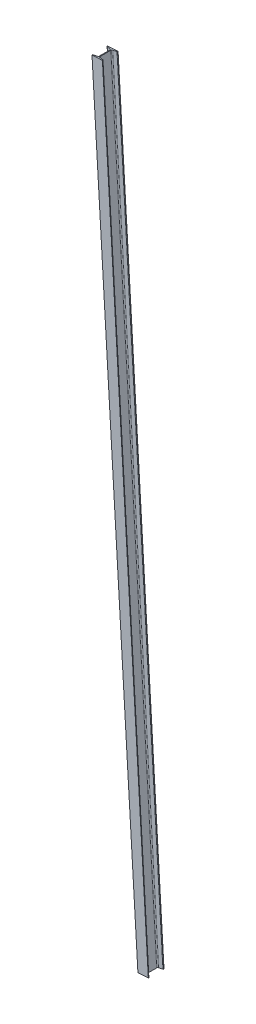
ISO-10303-21;
HEADER;
FILE_DESCRIPTION(('STEP AP214'),'2;1');
FILE_NAME('part.step','',(''),(''),'','','');
FILE_SCHEMA(('AUTOMOTIVE_DESIGN { 1 0 10303 214 1 1 1 1 }'));
ENDSEC;
DATA;
#1=APPLICATION_CONTEXT('core data for automotive mechanical design processes');
#2=APPLICATION_PROTOCOL_DEFINITION('international standard','automotive_design',2000,#1);
#3=PRODUCT_CONTEXT('',#1,'mechanical');
#4=PRODUCT('Part','Part','',(#3));
#5=PRODUCT_RELATED_PRODUCT_CATEGORY('part','',(#4));
#6=PRODUCT_DEFINITION_FORMATION('','',#4);
#7=PRODUCT_DEFINITION_CONTEXT('part definition',#1,'design');
#8=PRODUCT_DEFINITION('design','',#6,#7);
#9=PRODUCT_DEFINITION_SHAPE('','',#8);
#10=(LENGTH_UNIT() NAMED_UNIT(*) SI_UNIT(.MILLI.,.METRE.));
#11=(NAMED_UNIT(*) PLANE_ANGLE_UNIT() SI_UNIT($,.RADIAN.));
#12=(NAMED_UNIT(*) SI_UNIT($,.STERADIAN.) SOLID_ANGLE_UNIT());
#13=UNCERTAINTY_MEASURE_WITH_UNIT(LENGTH_MEASURE(1.E-05),#10,'distance_accuracy_value','');
#14=(GEOMETRIC_REPRESENTATION_CONTEXT(3) GLOBAL_UNCERTAINTY_ASSIGNED_CONTEXT((#13)) GLOBAL_UNIT_ASSIGNED_CONTEXT((#10,
#11,#12)) REPRESENTATION_CONTEXT('',''));
#15=CARTESIAN_POINT('',(0.,0.,0.));
#16=DIRECTION('',(0.,0.,1.));
#17=DIRECTION('',(1.,0.,0.));
#18=AXIS2_PLACEMENT_3D('',#15,#16,#17);
#19=CARTESIAN_POINT('',(9330.85472374432,1018.28452404438,-60.3249999999981));
#20=DIRECTION('',(0.,0.,-1.));
#21=DIRECTION('',(0.,1.,0.));
#22=AXIS2_PLACEMENT_3D('',#19,#20,#21);
#23=PLANE('',#22);
#24=DIRECTION('',(0.998235524222362,0.0593787687688712,0.));
#25=VECTOR('',#24,1.);
#26=CARTESIAN_POINT('',(9628.28666484125,-3981.93922254552,-60.3250000000196));
#27=LINE('',#26,#25);
#28=CARTESIAN_POINT('',(9560.76581433575,-3985.9556143408,-60.3250000000198));
#29=VERTEX_POINT('',#28);
#30=CARTESIAN_POINT('',(9628.28666484125,-3981.93922254552,-60.3250000000196));
#31=VERTEX_POINT('',#30);
#32=EDGE_CURVE('E262',#29,#31,#27,.T.);
#33=ORIENTED_EDGE('',*,*,#32,.T.);
#34=DIRECTION('',(0.0593787687688694,-0.998235524222362,0.));
#35=VECTOR('',#34,1.);
#36=CARTESIAN_POINT('',(9330.85472374432,1018.28452404438,-60.3249999999981));
#37=LINE('',#36,#35);
#38=CARTESIAN_POINT('',(9330.85472374432,1018.28452404438,-60.3249999999981));
#39=VERTEX_POINT('',#38);
#40=EDGE_CURVE('E12',#39,#31,#37,.T.);
#41=ORIENTED_EDGE('',*,*,#40,.F.);
#42=DIRECTION('',(0.998235524222362,0.0593787687688712,0.));
#43=VECTOR('',#42,1.);
#44=CARTESIAN_POINT('',(9330.85472374432,1018.28452404438,-60.3249999999981));
#45=LINE('',#44,#43);
#46=CARTESIAN_POINT('',(9263.33387323881,1014.2681322491,-60.3249999999983));
#47=VERTEX_POINT('',#46);
#48=EDGE_CURVE('E300',#47,#39,#45,.T.);
#49=ORIENTED_EDGE('',*,*,#48,.F.);
#50=DIRECTION('',(0.0593787687688694,-0.998235524222362,0.));
#51=VECTOR('',#50,1.);
#52=CARTESIAN_POINT('',(9263.33387323881,1014.2681322491,-60.3249999999983));
#53=LINE('',#52,#51);
#54=EDGE_CURVE('E258',#47,#29,#53,.T.);
#55=ORIENTED_EDGE('',*,*,#54,.T.);
#56=EDGE_LOOP('',(#33,#41,#49,#55));
#57=FACE_BOUND('',#56,.T.);
#58=ADVANCED_FACE('F94',(#57),#23,.F.);
#59=CARTESIAN_POINT('',(9330.85472374432,1018.28452404438,-62.7863839406728));
#60=DIRECTION('',(-0.998235524222362,-0.0593787687688694,0.));
#61=DIRECTION('',(0.0593787687688694,-0.998235524222362,0.));
#62=AXIS2_PLACEMENT_3D('',#59,#60,#61);
#63=PLANE('',#62);
#64=DIRECTION('',(0.,0.,-1.));
#65=VECTOR('',#64,1.);
#66=CARTESIAN_POINT('',(9628.28666484125,-3981.93922254552,-62.7863839406943));
#67=LINE('',#66,#65);
#68=CARTESIAN_POINT('',(9628.28666484125,-3981.93922254552,-62.7863839406943));
#69=VERTEX_POINT('',#68);
#70=EDGE_CURVE('E265',#31,#69,#67,.T.);
#71=ORIENTED_EDGE('',*,*,#70,.T.);
#72=DIRECTION('',(0.0593787687688694,-0.998235524222362,0.));
#73=VECTOR('',#72,1.);
#74=CARTESIAN_POINT('',(9330.85472374432,1018.28452404438,-62.7863839406728));
#75=LINE('',#74,#73);
#76=CARTESIAN_POINT('',(9330.85472374432,1018.28452404438,-62.7863839406728));
#77=VERTEX_POINT('',#76);
#78=EDGE_CURVE('E102',#77,#69,#75,.T.);
#79=ORIENTED_EDGE('',*,*,#78,.F.);
#80=DIRECTION('',(0.,0.,-1.));
#81=VECTOR('',#80,1.);
#82=CARTESIAN_POINT('',(9330.85472374432,1018.28452404438,-62.7863839406728));
#83=LINE('',#82,#81);
#84=EDGE_CURVE('E189',#39,#77,#83,.T.);
#85=ORIENTED_EDGE('',*,*,#84,.F.);
#86=ORIENTED_EDGE('',*,*,#40,.T.);
#87=EDGE_LOOP('',(#71,#79,#85,#86));
#88=FACE_BOUND('',#87,.T.);
#89=ADVANCED_FACE('F418',(#88),#63,.F.);
#90=CARTESIAN_POINT('',(9328.06565368964,1018.11861976444,-62.7863839406729));
#91=DIRECTION('',(0.0593787687688694,-0.998235524222362,0.));
#92=DIRECTION('',(0.998235524222362,0.0593787687688694,0.));
#93=AXIS2_PLACEMENT_3D('',#90,#91,#92);
#94=CYLINDRICAL_SURFACE('',#93,2.79400000000066);
#95=CARTESIAN_POINT('',(9625.49759478657,-3982.10512682546,-62.7863839406944));
#96=DIRECTION('',(-0.0593787687688694,0.998235524222362,0.));
#97=DIRECTION('',(-0.998235524222362,-0.0593787687688694,0.));
#98=AXIS2_PLACEMENT_3D('',#95,#96,#97);
#99=CIRCLE('',#98,2.79400000000066);
#100=CARTESIAN_POINT('',(9625.956147624,-3982.07785039396,-65.5423631299426));
#101=VERTEX_POINT('',#100);
#102=EDGE_CURVE('E267',#69,#101,#99,.T.);
#103=ORIENTED_EDGE('',*,*,#102,.T.);
#104=DIRECTION('',(0.0593787687688694,-0.998235524222362,0.));
#105=VECTOR('',#104,1.);
#106=CARTESIAN_POINT('',(9328.52420652707,1018.14589619595,-65.5423631299211));
#107=LINE('',#106,#105);
#108=CARTESIAN_POINT('',(9328.52420652707,1018.14589619595,-65.5423631299211));
#109=VERTEX_POINT('',#108);
#110=EDGE_CURVE('E343',#109,#101,#107,.T.);
#111=ORIENTED_EDGE('',*,*,#110,.F.);
#112=CARTESIAN_POINT('',(9328.06565368964,1018.11861976444,-62.7863839406729));
#113=DIRECTION('',(-0.0593787687688694,0.998235524222362,0.));
#114=DIRECTION('',(-0.998235524222362,-0.0593787687688694,0.));
#115=AXIS2_PLACEMENT_3D('',#112,#113,#114);
#116=CIRCLE('',#115,2.79400000000066);
#117=EDGE_CURVE('E351',#77,#109,#116,.T.);
#118=ORIENTED_EDGE('',*,*,#117,.F.);
#119=ORIENTED_EDGE('',*,*,#78,.T.);
#120=EDGE_LOOP('',(#103,#111,#118,#119));
#121=FACE_BOUND('',#120,.T.);
#122=ADVANCED_FACE('F349',(#121),#94,.T.);
#123=CARTESIAN_POINT('',(9305.68516443046,1016.78734486548,-69.3558766828892));
#124=DIRECTION('',(-0.16412055741946,-0.00976250232811939,0.986391978972163));
#125=DIRECTION('',(0.986438987092076,0.,0.164128378852529));
#126=AXIS2_PLACEMENT_3D('',#123,#124,#125);
#127=PLANE('',#126);
#128=DIRECTION('',(-0.984651514218009,-0.0585707412348551,-0.164410656039628));
#129=VECTOR('',#128,1.);
#130=CARTESIAN_POINT('',(9603.11710552739,-3983.43640172443,-69.3558766829107));
#131=LINE('',#130,#129);
#132=CARTESIAN_POINT('',(9603.11710552739,-3983.43640172443,-69.3558766829104));
#133=VERTEX_POINT('',#132);
#134=EDGE_CURVE('E269',#101,#133,#131,.T.);
#135=ORIENTED_EDGE('',*,*,#134,.T.);
#136=DIRECTION('',(0.0593787687688694,-0.998235524222362,0.));
#137=VECTOR('',#136,1.);
#138=CARTESIAN_POINT('',(9305.68516443046,1016.78734486548,-69.355876682889));
#139=LINE('',#138,#137);
#140=CARTESIAN_POINT('',(9305.68516443046,1016.78734486548,-69.355876682889));
#141=VERTEX_POINT('',#140);
#142=EDGE_CURVE('E340',#141,#133,#139,.T.);
#143=ORIENTED_EDGE('',*,*,#142,.F.);
#144=DIRECTION('',(-0.984651514218009,-0.0585707412348551,-0.164410656039628));
#145=VECTOR('',#144,1.);
#146=CARTESIAN_POINT('',(9305.68516443046,1016.78734486548,-69.3558766828892));
#147=LINE('',#146,#145);
#148=EDGE_CURVE('E369',#109,#141,#147,.T.);
#149=ORIENTED_EDGE('',*,*,#148,.F.);
#150=ORIENTED_EDGE('',*,*,#110,.T.);
#151=EDGE_LOOP('',(#135,#143,#149,#150));
#152=FACE_BOUND('',#151,.T.);
#153=ADVANCED_FACE('F360',(#152),#127,.F.);
#154=CARTESIAN_POINT('',(9306.89407645641,1016.85925545762,-76.6216399999982));
#155=DIRECTION('',(0.0593787687688694,-0.998235524222362,0.));
#156=DIRECTION('',(0.998235524222362,0.0593787687688694,0.));
#157=AXIS2_PLACEMENT_3D('',#154,#155,#156);
#158=CYLINDRICAL_SURFACE('',#157,7.36600000000023);
#159=CARTESIAN_POINT('',(9604.32601755334,-3983.36449113228,-76.6216400000196));
#160=DIRECTION('',(0.0593787687688694,-0.998235524222362,0.));
#161=DIRECTION('',(-0.998235524222362,-0.0593787687688694,0.));
#162=AXIS2_PLACEMENT_3D('',#159,#160,#161);
#163=CIRCLE('',#162,7.36600000000023);
#164=CARTESIAN_POINT('',(9596.97301468192,-3983.80187514303,-76.6216400000196));
#165=VERTEX_POINT('',#164);
#166=EDGE_CURVE('E271',#133,#165,#163,.T.);
#167=ORIENTED_EDGE('',*,*,#166,.T.);
#168=DIRECTION('',(0.0593787687688694,-0.998235524222362,0.));
#169=VECTOR('',#168,1.);
#170=CARTESIAN_POINT('',(9299.54107358499,1016.42187144687,-76.6216399999982));
#171=LINE('',#170,#169);
#172=CARTESIAN_POINT('',(9299.54107358499,1016.42187144687,-76.6216399999982));
#173=VERTEX_POINT('',#172);
#174=EDGE_CURVE('E337',#173,#165,#171,.T.);
#175=ORIENTED_EDGE('',*,*,#174,.F.);
#176=CARTESIAN_POINT('',(9306.89407645641,1016.85925545762,-76.6216399999982));
#177=DIRECTION('',(0.0593787687688694,-0.998235524222362,0.));
#178=DIRECTION('',(-0.998235524222362,-0.0593787687688694,0.));
#179=AXIS2_PLACEMENT_3D('',#176,#177,#178);
#180=CIRCLE('',#179,7.36600000000023);
#181=EDGE_CURVE('E366',#141,#173,#180,.T.);
#182=ORIENTED_EDGE('',*,*,#181,.F.);
#183=ORIENTED_EDGE('',*,*,#142,.T.);
#184=EDGE_LOOP('',(#167,#175,#182,#183));
#185=FACE_BOUND('',#184,.T.);
#186=ADVANCED_FACE('F364',(#185),#158,.F.);
#187=CARTESIAN_POINT('',(9299.54107358499,1016.42187144687,-145.628359999998));
#188=DIRECTION('',(-0.998235524222362,-0.0593787687688694,0.));
#189=DIRECTION('',(0.0593787687688694,-0.998235524222362,0.));
#190=AXIS2_PLACEMENT_3D('',#187,#188,#189);
#191=PLANE('',#190);
#192=DIRECTION('',(0.,0.,-1.));
#193=VECTOR('',#192,1.);
#194=CARTESIAN_POINT('',(9596.97301468192,-3983.80187514303,-145.62836000002));
#195=LINE('',#194,#193);
#196=CARTESIAN_POINT('',(9596.97301468192,-3983.80187514303,-145.62836000002));
#197=VERTEX_POINT('',#196);
#198=EDGE_CURVE('E273',#165,#197,#195,.T.);
#199=ORIENTED_EDGE('',*,*,#198,.T.);
#200=DIRECTION('',(0.0593787687688694,-0.998235524222362,0.));
#201=VECTOR('',#200,1.);
#202=CARTESIAN_POINT('',(9299.54107358499,1016.42187144687,-145.628359999998));
#203=LINE('',#202,#201);
#204=CARTESIAN_POINT('',(9299.54107358499,1016.42187144687,-145.628359999998));
#205=VERTEX_POINT('',#204);
#206=EDGE_CURVE('E334',#205,#197,#203,.T.);
#207=ORIENTED_EDGE('',*,*,#206,.F.);
#208=DIRECTION('',(0.,0.,-1.));
#209=VECTOR('',#208,1.);
#210=CARTESIAN_POINT('',(9299.54107358499,1016.42187144687,-145.628359999998));
#211=LINE('',#210,#209);
#212=EDGE_CURVE('E368',#173,#205,#211,.T.);
#213=ORIENTED_EDGE('',*,*,#212,.F.);
#214=ORIENTED_EDGE('',*,*,#174,.T.);
#215=EDGE_LOOP('',(#199,#207,#213,#214));
#216=FACE_BOUND('',#215,.T.);
#217=ADVANCED_FACE('F431',(#216),#191,.F.);
#218=CARTESIAN_POINT('',(9306.89407645641,1016.85925545763,-145.628359999998));
#219=DIRECTION('',(0.0593787687688694,-0.998235524222362,0.));
#220=DIRECTION('',(0.998235524222362,0.0593787687688694,0.));
#221=AXIS2_PLACEMENT_3D('',#218,#219,#220);
#222=CYLINDRICAL_SURFACE('',#221,7.36600000000023);
#223=CARTESIAN_POINT('',(9604.32601755334,-3983.36449113228,-145.62836000002));
#224=DIRECTION('',(0.0593787687688694,-0.998235524222362,0.));
#225=DIRECTION('',(-0.998235524222362,-0.0593787687688694,0.));
#226=AXIS2_PLACEMENT_3D('',#223,#224,#225);
#227=CIRCLE('',#226,7.36600000000023);
#228=CARTESIAN_POINT('',(9603.11710552739,-3983.43640172443,-152.894123317129));
#229=VERTEX_POINT('',#228);
#230=EDGE_CURVE('E275',#197,#229,#227,.T.);
#231=ORIENTED_EDGE('',*,*,#230,.T.);
#232=DIRECTION('',(0.0593787687688694,-0.998235524222362,0.));
#233=VECTOR('',#232,1.);
#234=CARTESIAN_POINT('',(9305.68516443046,1016.78734486548,-152.894123317107));
#235=LINE('',#234,#233);
#236=CARTESIAN_POINT('',(9305.68516443046,1016.78734486548,-152.894123317107));
#237=VERTEX_POINT('',#236);
#238=EDGE_CURVE('E331',#237,#229,#235,.T.);
#239=ORIENTED_EDGE('',*,*,#238,.F.);
#240=CARTESIAN_POINT('',(9306.89407645641,1016.85925545763,-145.628359999998));
#241=DIRECTION('',(0.0593787687688694,-0.998235524222362,0.));
#242=DIRECTION('',(-0.998235524222362,-0.0593787687688694,0.));
#243=AXIS2_PLACEMENT_3D('',#240,#241,#242);
#244=CIRCLE('',#243,7.36600000000023);
#245=EDGE_CURVE('E371',#205,#237,#244,.T.);
#246=ORIENTED_EDGE('',*,*,#245,.F.);
#247=ORIENTED_EDGE('',*,*,#206,.T.);
#248=EDGE_LOOP('',(#231,#239,#246,#247));
#249=FACE_BOUND('',#248,.T.);
#250=ADVANCED_FACE('F434',(#249),#222,.F.);
#251=CARTESIAN_POINT('',(9328.52420652707,1018.14589619595,-156.707636870075));
#252=DIRECTION('',(-0.164120557419453,-0.00976250232811049,-0.986391978972164));
#253=DIRECTION('',(-0.986438987092077,0.,0.164128378852522));
#254=AXIS2_PLACEMENT_3D('',#251,#252,#253);
#255=PLANE('',#254);
#256=DIRECTION('',(0.984651514218011,0.0585707412348552,-0.16441065603962));
#257=VECTOR('',#256,1.);
#258=CARTESIAN_POINT('',(9625.956147624,-3982.07785039396,-156.707636870096));
#259=LINE('',#258,#257);
#260=CARTESIAN_POINT('',(9625.956147624,-3982.07785039396,-156.707636870097));
#261=VERTEX_POINT('',#260);
#262=EDGE_CURVE('E277',#229,#261,#259,.T.);
#263=ORIENTED_EDGE('',*,*,#262,.T.);
#264=DIRECTION('',(0.0593787687688694,-0.998235524222362,0.));
#265=VECTOR('',#264,1.);
#266=CARTESIAN_POINT('',(9328.52420652707,1018.14589619595,-156.707636870075));
#267=LINE('',#266,#265);
#268=CARTESIAN_POINT('',(9328.52420652707,1018.14589619595,-156.707636870075));
#269=VERTEX_POINT('',#268);
#270=EDGE_CURVE('E328',#269,#261,#267,.T.);
#271=ORIENTED_EDGE('',*,*,#270,.F.);
#272=DIRECTION('',(0.984651514218011,0.0585707412348552,-0.16441065603962));
#273=VECTOR('',#272,1.);
#274=CARTESIAN_POINT('',(9328.52420652707,1018.14589619595,-156.707636870075));
#275=LINE('',#274,#273);
#276=EDGE_CURVE('E377',#237,#269,#275,.T.);
#277=ORIENTED_EDGE('',*,*,#276,.F.);
#278=ORIENTED_EDGE('',*,*,#238,.T.);
#279=EDGE_LOOP('',(#263,#271,#277,#278));
#280=FACE_BOUND('',#279,.T.);
#281=ADVANCED_FACE('F438',(#280),#255,.F.);
#282=CARTESIAN_POINT('',(9328.06565368964,1018.11861976444,-159.463616059323));
#283=DIRECTION('',(0.0593787687688694,-0.998235524222362,0.));
#284=DIRECTION('',(0.998235524222362,0.0593787687688694,0.));
#285=AXIS2_PLACEMENT_3D('',#282,#283,#284);
#286=CYLINDRICAL_SURFACE('',#285,2.79399999999963);
#287=CARTESIAN_POINT('',(9625.49759478658,-3982.10512682546,-159.463616059345));
#288=DIRECTION('',(-0.0593787687688694,0.998235524222362,0.));
#289=DIRECTION('',(-0.998235524222362,-0.0593787687688694,0.));
#290=AXIS2_PLACEMENT_3D('',#287,#288,#289);
#291=CIRCLE('',#290,2.79399999999963);
#292=CARTESIAN_POINT('',(9628.28666484125,-3981.93922254552,-159.463616059345));
#293=VERTEX_POINT('',#292);
#294=EDGE_CURVE('E279',#261,#293,#291,.T.);
#295=ORIENTED_EDGE('',*,*,#294,.T.);
#296=DIRECTION('',(0.0593787687688694,-0.998235524222362,0.));
#297=VECTOR('',#296,1.);
#298=CARTESIAN_POINT('',(9330.85472374432,1018.28452404438,-159.463616059323));
#299=LINE('',#298,#297);
#300=CARTESIAN_POINT('',(9330.85472374432,1018.28452404438,-159.463616059323));
#301=VERTEX_POINT('',#300);
#302=EDGE_CURVE('E325',#301,#293,#299,.T.);
#303=ORIENTED_EDGE('',*,*,#302,.F.);
#304=CARTESIAN_POINT('',(9328.06565368964,1018.11861976444,-159.463616059323));
#305=DIRECTION('',(-0.0593787687688694,0.998235524222362,0.));
#306=DIRECTION('',(-0.998235524222362,-0.0593787687688694,0.));
#307=AXIS2_PLACEMENT_3D('',#304,#305,#306);
#308=CIRCLE('',#307,2.79399999999963);
#309=EDGE_CURVE('E379',#269,#301,#308,.T.);
#310=ORIENTED_EDGE('',*,*,#309,.F.);
#311=ORIENTED_EDGE('',*,*,#270,.T.);
#312=EDGE_LOOP('',(#295,#303,#310,#311));
#313=FACE_BOUND('',#312,.T.);
#314=ADVANCED_FACE('F442',(#313),#286,.T.);
#315=CARTESIAN_POINT('',(9330.85472374432,1018.28452404438,-161.924999999998));
#316=DIRECTION('',(-0.998235524222362,-0.0593787687688694,0.));
#317=DIRECTION('',(0.0593787687688694,-0.998235524222362,0.));
#318=AXIS2_PLACEMENT_3D('',#315,#316,#317);
#319=PLANE('',#318);
#320=DIRECTION('',(0.,0.,-1.));
#321=VECTOR('',#320,1.);
#322=CARTESIAN_POINT('',(9628.28666484125,-3981.93922254552,-161.92500000002));
#323=LINE('',#322,#321);
#324=CARTESIAN_POINT('',(9628.28666484125,-3981.93922254552,-161.92500000002));
#325=VERTEX_POINT('',#324);
#326=EDGE_CURVE('E281',#293,#325,#323,.T.);
#327=ORIENTED_EDGE('',*,*,#326,.T.);
#328=DIRECTION('',(0.0593787687688694,-0.998235524222362,0.));
#329=VECTOR('',#328,1.);
#330=CARTESIAN_POINT('',(9330.85472374432,1018.28452404438,-161.924999999998));
#331=LINE('',#330,#329);
#332=CARTESIAN_POINT('',(9330.85472374432,1018.28452404438,-161.924999999998));
#333=VERTEX_POINT('',#332);
#334=EDGE_CURVE('E322',#333,#325,#331,.T.);
#335=ORIENTED_EDGE('',*,*,#334,.F.);
#336=DIRECTION('',(0.,0.,-1.));
#337=VECTOR('',#336,1.);
#338=CARTESIAN_POINT('',(9330.85472374432,1018.28452404438,-161.924999999998));
#339=LINE('',#338,#337);
#340=EDGE_CURVE('E381',#301,#333,#339,.T.);
#341=ORIENTED_EDGE('',*,*,#340,.F.);
#342=ORIENTED_EDGE('',*,*,#302,.T.);
#343=EDGE_LOOP('',(#327,#335,#341,#342));
#344=FACE_BOUND('',#343,.T.);
#345=ADVANCED_FACE('F446',(#344),#319,.F.);
#346=CARTESIAN_POINT('',(9263.33387323881,1014.2681322491,-161.924999999998));
#347=DIRECTION('',(0.,0.,1.));
#348=DIRECTION('',(0.,-1.,0.));
#349=AXIS2_PLACEMENT_3D('',#346,#347,#348);
#350=PLANE('',#349);
#351=DIRECTION('',(-0.998235524222362,-0.0593787687688712,0.));
#352=VECTOR('',#351,1.);
#353=CARTESIAN_POINT('',(9560.76581433575,-3985.9556143408,-161.92500000002));
#354=LINE('',#353,#352);
#355=CARTESIAN_POINT('',(9560.76581433575,-3985.9556143408,-161.92500000002));
#356=VERTEX_POINT('',#355);
#357=EDGE_CURVE('E283',#325,#356,#354,.T.);
#358=ORIENTED_EDGE('',*,*,#357,.T.);
#359=DIRECTION('',(0.0593787687688694,-0.998235524222362,0.));
#360=VECTOR('',#359,1.);
#361=CARTESIAN_POINT('',(9263.33387323881,1014.2681322491,-161.924999999998));
#362=LINE('',#361,#360);
#363=CARTESIAN_POINT('',(9263.33387323881,1014.2681322491,-161.924999999998));
#364=VERTEX_POINT('',#363);
#365=EDGE_CURVE('E319',#364,#356,#362,.T.);
#366=ORIENTED_EDGE('',*,*,#365,.F.);
#367=DIRECTION('',(-0.998235524222362,-0.0593787687688712,0.));
#368=VECTOR('',#367,1.);
#369=CARTESIAN_POINT('',(9263.33387323881,1014.2681322491,-161.924999999998));
#370=LINE('',#369,#368);
#371=EDGE_CURVE('E383',#333,#364,#370,.T.);
#372=ORIENTED_EDGE('',*,*,#371,.F.);
#373=ORIENTED_EDGE('',*,*,#334,.T.);
#374=EDGE_LOOP('',(#358,#366,#372,#373));
#375=FACE_BOUND('',#374,.T.);
#376=ADVANCED_FACE('F450',(#375),#350,.F.);
#377=CARTESIAN_POINT('',(9263.33387323881,1014.2681322491,-159.463616059323));
#378=DIRECTION('',(0.998235524222362,0.0593787687688694,0.));
#379=DIRECTION('',(-0.0593787687688694,0.998235524222362,0.));
#380=AXIS2_PLACEMENT_3D('',#377,#378,#379);
#381=PLANE('',#380);
#382=DIRECTION('',(0.,0.,1.));
#383=VECTOR('',#382,1.);
#384=CARTESIAN_POINT('',(9560.76581433575,-3985.9556143408,-159.463616059345));
#385=LINE('',#384,#383);
#386=CARTESIAN_POINT('',(9560.76581433575,-3985.9556143408,-159.463616059345));
#387=VERTEX_POINT('',#386);
#388=EDGE_CURVE('E285',#356,#387,#385,.T.);
#389=ORIENTED_EDGE('',*,*,#388,.T.);
#390=DIRECTION('',(0.0593787687688694,-0.998235524222362,0.));
#391=VECTOR('',#390,1.);
#392=CARTESIAN_POINT('',(9263.33387323881,1014.2681322491,-159.463616059323));
#393=LINE('',#392,#391);
#394=CARTESIAN_POINT('',(9263.33387323881,1014.2681322491,-159.463616059323));
#395=VERTEX_POINT('',#394);
#396=EDGE_CURVE('E316',#395,#387,#393,.T.);
#397=ORIENTED_EDGE('',*,*,#396,.F.);
#398=DIRECTION('',(0.,0.,1.));
#399=VECTOR('',#398,1.);
#400=CARTESIAN_POINT('',(9263.33387323881,1014.2681322491,-159.463616059323));
#401=LINE('',#400,#399);
#402=EDGE_CURVE('E385',#364,#395,#401,.T.);
#403=ORIENTED_EDGE('',*,*,#402,.F.);
#404=ORIENTED_EDGE('',*,*,#365,.T.);
#405=EDGE_LOOP('',(#389,#397,#403,#404));
#406=FACE_BOUND('',#405,.T.);
#407=ADVANCED_FACE('F454',(#406),#381,.F.);
#408=CARTESIAN_POINT('',(9266.12294329349,1014.43403652904,-159.463616059323));
#409=DIRECTION('',(0.0593787687688694,-0.998235524222362,0.));
#410=DIRECTION('',(0.998235524222362,0.0593787687688694,0.));
#411=AXIS2_PLACEMENT_3D('',#408,#409,#410);
#412=CYLINDRICAL_SURFACE('',#411,2.79400000000067);
#413=CARTESIAN_POINT('',(9563.55488439042,-3985.78971006086,-159.463616059345));
#414=DIRECTION('',(-0.0593787687688694,0.998235524222362,0.));
#415=DIRECTION('',(0.998235524222362,0.0593787687688694,0.));
#416=AXIS2_PLACEMENT_3D('',#413,#414,#415);
#417=CIRCLE('',#416,2.79400000000067);
#418=CARTESIAN_POINT('',(9563.09633155299,-3985.81698649237,-156.707636870097));
#419=VERTEX_POINT('',#418);
#420=EDGE_CURVE('E287',#387,#419,#417,.T.);
#421=ORIENTED_EDGE('',*,*,#420,.T.);
#422=DIRECTION('',(0.0593787687688694,-0.998235524222362,0.));
#423=VECTOR('',#422,1.);
#424=CARTESIAN_POINT('',(9265.66439045606,1014.40676009754,-156.707636870075));
#425=LINE('',#424,#423);
#426=CARTESIAN_POINT('',(9265.66439045606,1014.40676009754,-156.707636870075));
#427=VERTEX_POINT('',#426);
#428=EDGE_CURVE('E313',#427,#419,#425,.T.);
#429=ORIENTED_EDGE('',*,*,#428,.F.);
#430=CARTESIAN_POINT('',(9266.12294329349,1014.43403652904,-159.463616059323));
#431=DIRECTION('',(-0.0593787687688694,0.998235524222362,0.));
#432=DIRECTION('',(0.998235524222362,0.0593787687688694,0.));
#433=AXIS2_PLACEMENT_3D('',#430,#431,#432);
#434=CIRCLE('',#433,2.79400000000067);
#435=EDGE_CURVE('E387',#395,#427,#434,.T.);
#436=ORIENTED_EDGE('',*,*,#435,.F.);
#437=ORIENTED_EDGE('',*,*,#396,.T.);
#438=EDGE_LOOP('',(#421,#429,#436,#437));
#439=FACE_BOUND('',#438,.T.);
#440=ADVANCED_FACE('F458',(#439),#412,.T.);
#441=CARTESIAN_POINT('',(9288.50343255267,1015.76531142801,-152.894123317107));
#442=DIRECTION('',(0.16412055741946,0.00976250232811937,-0.986391978972163));
#443=DIRECTION('',(-0.986438987092076,0.,-0.164128378852529));
#444=AXIS2_PLACEMENT_3D('',#441,#442,#443);
#445=PLANE('',#444);
#446=DIRECTION('',(0.984651514218009,0.0585707412348551,0.164410656039627));
#447=VECTOR('',#446,1.);
#448=CARTESIAN_POINT('',(9585.93537364961,-3984.45843516189,-152.894123317129));
#449=LINE('',#448,#447);
#450=CARTESIAN_POINT('',(9585.93537364961,-3984.45843516189,-152.894123317129));
#451=VERTEX_POINT('',#450);
#452=EDGE_CURVE('E289',#419,#451,#449,.T.);
#453=ORIENTED_EDGE('',*,*,#452,.T.);
#454=DIRECTION('',(0.0593787687688694,-0.998235524222362,0.));
#455=VECTOR('',#454,1.);
#456=CARTESIAN_POINT('',(9288.50343255267,1015.76531142801,-152.894123317107));
#457=LINE('',#456,#455);
#458=CARTESIAN_POINT('',(9288.50343255267,1015.76531142801,-152.894123317107));
#459=VERTEX_POINT('',#458);
#460=EDGE_CURVE('E310',#459,#451,#457,.T.);
#461=ORIENTED_EDGE('',*,*,#460,.F.);
#462=DIRECTION('',(0.984651514218009,0.0585707412348551,0.164410656039627));
#463=VECTOR('',#462,1.);
#464=CARTESIAN_POINT('',(9288.50343255267,1015.76531142801,-152.894123317107));
#465=LINE('',#464,#463);
#466=EDGE_CURVE('E389',#427,#459,#465,.T.);
#467=ORIENTED_EDGE('',*,*,#466,.F.);
#468=ORIENTED_EDGE('',*,*,#428,.T.);
#469=EDGE_LOOP('',(#453,#461,#467,#468));
#470=FACE_BOUND('',#469,.T.);
#471=ADVANCED_FACE('F462',(#470),#445,.F.);
#472=CARTESIAN_POINT('',(9287.29452052672,1015.69340083586,-145.628359999998));
#473=DIRECTION('',(0.0593787687688694,-0.998235524222362,0.));
#474=DIRECTION('',(0.998235524222362,0.0593787687688694,0.));
#475=AXIS2_PLACEMENT_3D('',#472,#473,#474);
#476=CYLINDRICAL_SURFACE('',#475,7.36600000000023);
#477=CARTESIAN_POINT('',(9584.72646162366,-3984.53034575404,-145.62836000002));
#478=DIRECTION('',(0.0593787687688694,-0.998235524222362,0.));
#479=DIRECTION('',(-0.998235524222362,-0.0593787687688694,0.));
#480=AXIS2_PLACEMENT_3D('',#477,#478,#479);
#481=CIRCLE('',#480,7.36600000000023);
#482=CARTESIAN_POINT('',(9592.07946449508,-3984.09296174329,-145.62836000002));
#483=VERTEX_POINT('',#482);
#484=EDGE_CURVE('E291',#451,#483,#481,.T.);
#485=ORIENTED_EDGE('',*,*,#484,.T.);
#486=DIRECTION('',(0.0593787687688694,-0.998235524222362,0.));
#487=VECTOR('',#486,1.);
#488=CARTESIAN_POINT('',(9294.64752339814,1016.13078484661,-145.628359999998));
#489=LINE('',#488,#487);
#490=CARTESIAN_POINT('',(9294.64752339814,1016.13078484661,-145.628359999998));
#491=VERTEX_POINT('',#490);
#492=EDGE_CURVE('E307',#491,#483,#489,.T.);
#493=ORIENTED_EDGE('',*,*,#492,.F.);
#494=CARTESIAN_POINT('',(9287.29452052672,1015.69340083586,-145.628359999998));
#495=DIRECTION('',(0.0593787687688694,-0.998235524222362,0.));
#496=DIRECTION('',(-0.998235524222362,-0.0593787687688694,0.));
#497=AXIS2_PLACEMENT_3D('',#494,#495,#496);
#498=CIRCLE('',#497,7.36600000000023);
#499=EDGE_CURVE('E391',#459,#491,#498,.T.);
#500=ORIENTED_EDGE('',*,*,#499,.F.);
#501=ORIENTED_EDGE('',*,*,#460,.T.);
#502=EDGE_LOOP('',(#485,#493,#500,#501));
#503=FACE_BOUND('',#502,.T.);
#504=ADVANCED_FACE('F466',(#503),#476,.F.);
#505=CARTESIAN_POINT('',(9294.64752339814,1016.13078484661,-76.6216399999982));
#506=DIRECTION('',(0.998235524222362,0.0593787687688694,0.));
#507=DIRECTION('',(-0.0593787687688694,0.998235524222362,0.));
#508=AXIS2_PLACEMENT_3D('',#505,#506,#507);
#509=PLANE('',#508);
#510=DIRECTION('',(0.,0.,1.));
#511=VECTOR('',#510,1.);
#512=CARTESIAN_POINT('',(9592.07946449508,-3984.09296174329,-76.6216400000197));
#513=LINE('',#512,#511);
#514=CARTESIAN_POINT('',(9592.07946449508,-3984.09296174329,-76.6216400000197));
#515=VERTEX_POINT('',#514);
#516=EDGE_CURVE('E293',#483,#515,#513,.T.);
#517=ORIENTED_EDGE('',*,*,#516,.T.);
#518=DIRECTION('',(0.0593787687688694,-0.998235524222362,0.));
#519=VECTOR('',#518,1.);
#520=CARTESIAN_POINT('',(9294.64752339814,1016.13078484661,-76.6216399999982));
#521=LINE('',#520,#519);
#522=CARTESIAN_POINT('',(9294.64752339814,1016.13078484661,-76.6216399999982));
#523=VERTEX_POINT('',#522);
#524=EDGE_CURVE('E304',#523,#515,#521,.T.);
#525=ORIENTED_EDGE('',*,*,#524,.F.);
#526=DIRECTION('',(0.,0.,1.));
#527=VECTOR('',#526,1.);
#528=CARTESIAN_POINT('',(9294.64752339814,1016.13078484661,-76.6216399999982));
#529=LINE('',#528,#527);
#530=EDGE_CURVE('E393',#491,#523,#529,.T.);
#531=ORIENTED_EDGE('',*,*,#530,.F.);
#532=ORIENTED_EDGE('',*,*,#492,.T.);
#533=EDGE_LOOP('',(#517,#525,#531,#532));
#534=FACE_BOUND('',#533,.T.);
#535=ADVANCED_FACE('F399',(#534),#509,.F.);
#536=CARTESIAN_POINT('',(9287.29452052672,1015.69340083586,-76.6216399999982));
#537=DIRECTION('',(0.0593787687688694,-0.998235524222362,0.));
#538=DIRECTION('',(0.998235524222362,0.0593787687688694,0.));
#539=AXIS2_PLACEMENT_3D('',#536,#537,#538);
#540=CYLINDRICAL_SURFACE('',#539,7.36600000000023);
#541=CARTESIAN_POINT('',(9584.72646162366,-3984.53034575404,-76.6216400000197));
#542=DIRECTION('',(0.0593787687688694,-0.998235524222362,0.));
#543=DIRECTION('',(-0.998235524222362,-0.0593787687688694,0.));
#544=AXIS2_PLACEMENT_3D('',#541,#542,#543);
#545=CIRCLE('',#544,7.36600000000023);
#546=CARTESIAN_POINT('',(9585.93537364961,-3984.45843516189,-69.3558766829107));
#547=VERTEX_POINT('',#546);
#548=EDGE_CURVE('E295',#515,#547,#545,.T.);
#549=ORIENTED_EDGE('',*,*,#548,.T.);
#550=DIRECTION('',(0.0593787687688694,-0.998235524222362,0.));
#551=VECTOR('',#550,1.);
#552=CARTESIAN_POINT('',(9288.50343255267,1015.76531142801,-69.3558766828893));
#553=LINE('',#552,#551);
#554=CARTESIAN_POINT('',(9288.50343255267,1015.76531142801,-69.3558766828893));
#555=VERTEX_POINT('',#554);
#556=EDGE_CURVE('E253',#555,#547,#553,.T.);
#557=ORIENTED_EDGE('',*,*,#556,.F.);
#558=CARTESIAN_POINT('',(9287.29452052672,1015.69340083586,-76.6216399999982));
#559=DIRECTION('',(0.0593787687688694,-0.998235524222362,0.));
#560=DIRECTION('',(-0.998235524222362,-0.0593787687688694,0.));
#561=AXIS2_PLACEMENT_3D('',#558,#559,#560);
#562=CIRCLE('',#561,7.36600000000023);
#563=EDGE_CURVE('E244',#523,#555,#562,.T.);
#564=ORIENTED_EDGE('',*,*,#563,.F.);
#565=ORIENTED_EDGE('',*,*,#524,.T.);
#566=EDGE_LOOP('',(#549,#557,#564,#565));
#567=FACE_BOUND('',#566,.T.);
#568=ADVANCED_FACE('F403',(#567),#540,.F.);
#569=CARTESIAN_POINT('',(9265.66439045606,1014.40676009754,-65.5423631299214));
#570=DIRECTION('',(0.164120557419454,0.00976250232811056,0.986391978972164));
#571=DIRECTION('',(0.986438987092077,0.,-0.164128378852523));
#572=AXIS2_PLACEMENT_3D('',#569,#570,#571);
#573=PLANE('',#572);
#574=DIRECTION('',(-0.984651514218011,-0.0585707412348552,0.164410656039621));
#575=VECTOR('',#574,1.);
#576=CARTESIAN_POINT('',(9563.09633155299,-3985.81698649237,-65.5423631299428));
#577=LINE('',#576,#575);
#578=CARTESIAN_POINT('',(9563.09633155299,-3985.81698649237,-65.5423631299426));
#579=VERTEX_POINT('',#578);
#580=EDGE_CURVE('E252',#547,#579,#577,.T.);
#581=ORIENTED_EDGE('',*,*,#580,.T.);
#582=DIRECTION('',(0.0593787687688694,-0.998235524222362,0.));
#583=VECTOR('',#582,1.);
#584=CARTESIAN_POINT('',(9265.66439045606,1014.40676009754,-65.5423631299211));
#585=LINE('',#584,#583);
#586=CARTESIAN_POINT('',(9265.66439045606,1014.40676009754,-65.5423631299211));
#587=VERTEX_POINT('',#586);
#588=EDGE_CURVE('E249',#587,#579,#585,.T.);
#589=ORIENTED_EDGE('',*,*,#588,.F.);
#590=DIRECTION('',(-0.984651514218011,-0.0585707412348552,0.164410656039621));
#591=VECTOR('',#590,1.);
#592=CARTESIAN_POINT('',(9265.66439045606,1014.40676009754,-65.5423631299214));
#593=LINE('',#592,#591);
#594=EDGE_CURVE('E238',#555,#587,#593,.T.);
#595=ORIENTED_EDGE('',*,*,#594,.F.);
#596=ORIENTED_EDGE('',*,*,#556,.T.);
#597=EDGE_LOOP('',(#581,#589,#595,#596));
#598=FACE_BOUND('',#597,.T.);
#599=ADVANCED_FACE('F250',(#598),#573,.F.);
#600=CARTESIAN_POINT('',(9266.12294329349,1014.43403652904,-62.7863839406732));
#601=DIRECTION('',(0.0593787687688694,-0.998235524222362,0.));
#602=DIRECTION('',(0.998235524222362,0.0593787687688694,0.));
#603=AXIS2_PLACEMENT_3D('',#600,#601,#602);
#604=CYLINDRICAL_SURFACE('',#603,2.79399999999963);
#605=CARTESIAN_POINT('',(9563.55488439042,-3985.78971006086,-62.7863839406946));
#606=DIRECTION('',(-0.0593787687688694,0.998235524222362,0.));
#607=DIRECTION('',(0.998235524222362,0.0593787687688694,0.));
#608=AXIS2_PLACEMENT_3D('',#605,#606,#607);
#609=CIRCLE('',#608,2.79399999999963);
#610=CARTESIAN_POINT('',(9560.76581433575,-3985.9556143408,-62.7863839406946));
#611=VERTEX_POINT('',#610);
#612=EDGE_CURVE('E175',#579,#611,#609,.T.);
#613=ORIENTED_EDGE('',*,*,#612,.T.);
#614=DIRECTION('',(0.0593787687688694,-0.998235524222362,0.));
#615=VECTOR('',#614,1.);
#616=CARTESIAN_POINT('',(9263.33387323881,1014.2681322491,-62.7863839406732));
#617=LINE('',#616,#615);
#618=CARTESIAN_POINT('',(9263.33387323881,1014.2681322491,-62.7863839406732));
#619=VERTEX_POINT('',#618);
#620=EDGE_CURVE('E254',#619,#611,#617,.T.);
#621=ORIENTED_EDGE('',*,*,#620,.F.);
#622=CARTESIAN_POINT('',(9266.12294329349,1014.43403652904,-62.7863839406732));
#623=DIRECTION('',(-0.0593787687688694,0.998235524222362,0.));
#624=DIRECTION('',(0.998235524222362,0.0593787687688694,0.));
#625=AXIS2_PLACEMENT_3D('',#622,#623,#624);
#626=CIRCLE('',#625,2.79399999999963);
#627=EDGE_CURVE('E242',#587,#619,#626,.T.);
#628=ORIENTED_EDGE('',*,*,#627,.F.);
#629=ORIENTED_EDGE('',*,*,#588,.T.);
#630=EDGE_LOOP('',(#613,#621,#628,#629));
#631=FACE_BOUND('',#630,.T.);
#632=ADVANCED_FACE('F256',(#631),#604,.T.);
#633=CARTESIAN_POINT('',(9263.33387323881,1014.2681322491,-60.3249999999983));
#634=DIRECTION('',(0.998235524222362,0.0593787687688694,0.));
#635=DIRECTION('',(-0.0593787687688694,0.998235524222362,0.));
#636=AXIS2_PLACEMENT_3D('',#633,#634,#635);
#637=PLANE('',#636);
#638=DIRECTION('',(0.,0.,1.));
#639=VECTOR('',#638,1.);
#640=CARTESIAN_POINT('',(9560.76581433575,-3985.9556143408,-60.3250000000198));
#641=LINE('',#640,#639);
#642=EDGE_CURVE('E181',#611,#29,#641,.T.);
#643=ORIENTED_EDGE('',*,*,#642,.T.);
#644=ORIENTED_EDGE('',*,*,#54,.F.);
#645=DIRECTION('',(0.,0.,1.));
#646=VECTOR('',#645,1.);
#647=CARTESIAN_POINT('',(9263.33387323881,1014.2681322491,-60.3249999999983));
#648=LINE('',#647,#646);
#649=EDGE_CURVE('E110',#619,#47,#648,.T.);
#650=ORIENTED_EDGE('',*,*,#649,.F.);
#651=ORIENTED_EDGE('',*,*,#620,.T.);
#652=EDGE_LOOP('',(#643,#644,#650,#651));
#653=FACE_BOUND('',#652,.T.);
#654=ADVANCED_FACE('F407',(#653),#637,.F.);
#655=CARTESIAN_POINT('',(9266.12294329349,1014.43403652904,-62.7863839406732));
#656=DIRECTION('',(0.0593787687688694,-0.998235524222362,0.));
#657=DIRECTION('',(0.998235524222362,0.0593787687688694,0.));
#658=AXIS2_PLACEMENT_3D('',#655,#656,#657);
#659=PLANE('',#658);
#660=ORIENTED_EDGE('',*,*,#48,.T.);
#661=ORIENTED_EDGE('',*,*,#84,.T.);
#662=ORIENTED_EDGE('',*,*,#117,.T.);
#663=ORIENTED_EDGE('',*,*,#148,.T.);
#664=ORIENTED_EDGE('',*,*,#181,.T.);
#665=ORIENTED_EDGE('',*,*,#212,.T.);
#666=ORIENTED_EDGE('',*,*,#245,.T.);
#667=ORIENTED_EDGE('',*,*,#276,.T.);
#668=ORIENTED_EDGE('',*,*,#309,.T.);
#669=ORIENTED_EDGE('',*,*,#340,.T.);
#670=ORIENTED_EDGE('',*,*,#371,.T.);
#671=ORIENTED_EDGE('',*,*,#402,.T.);
#672=ORIENTED_EDGE('',*,*,#435,.T.);
#673=ORIENTED_EDGE('',*,*,#466,.T.);
#674=ORIENTED_EDGE('',*,*,#499,.T.);
#675=ORIENTED_EDGE('',*,*,#530,.T.);
#676=ORIENTED_EDGE('',*,*,#563,.T.);
#677=ORIENTED_EDGE('',*,*,#594,.T.);
#678=ORIENTED_EDGE('',*,*,#627,.T.);
#679=ORIENTED_EDGE('',*,*,#649,.T.);
#680=EDGE_LOOP('',(#660,#661,#662,#663,#664,#665,#666,#667,#668,#669,#670,#671,#672,#673,#674,
#675,#676,#677,#678,#679));
#681=FACE_BOUND('',#680,.T.);
#682=ADVANCED_FACE('F240',(#681),#659,.F.);
#683=CARTESIAN_POINT('',(9563.55488439042,-3985.78971006086,-62.7863839406946));
#684=DIRECTION('',(0.0593787687688694,-0.998235524222362,0.));
#685=DIRECTION('',(0.998235524222362,0.0593787687688694,0.));
#686=AXIS2_PLACEMENT_3D('',#683,#684,#685);
#687=PLANE('',#686);
#688=ORIENTED_EDGE('',*,*,#32,.F.);
#689=ORIENTED_EDGE('',*,*,#642,.F.);
#690=ORIENTED_EDGE('',*,*,#612,.F.);
#691=ORIENTED_EDGE('',*,*,#580,.F.);
#692=ORIENTED_EDGE('',*,*,#548,.F.);
#693=ORIENTED_EDGE('',*,*,#516,.F.);
#694=ORIENTED_EDGE('',*,*,#484,.F.);
#695=ORIENTED_EDGE('',*,*,#452,.F.);
#696=ORIENTED_EDGE('',*,*,#420,.F.);
#697=ORIENTED_EDGE('',*,*,#388,.F.);
#698=ORIENTED_EDGE('',*,*,#357,.F.);
#699=ORIENTED_EDGE('',*,*,#326,.F.);
#700=ORIENTED_EDGE('',*,*,#294,.F.);
#701=ORIENTED_EDGE('',*,*,#262,.F.);
#702=ORIENTED_EDGE('',*,*,#230,.F.);
#703=ORIENTED_EDGE('',*,*,#198,.F.);
#704=ORIENTED_EDGE('',*,*,#166,.F.);
#705=ORIENTED_EDGE('',*,*,#134,.F.);
#706=ORIENTED_EDGE('',*,*,#102,.F.);
#707=ORIENTED_EDGE('',*,*,#70,.F.);
#708=EDGE_LOOP('',(#688,#689,#690,#691,#692,#693,#694,#695,#696,#697,#698,#699,#700,#701,#702,
#703,#704,#705,#706,#707));
#709=FACE_BOUND('',#708,.T.);
#710=ADVANCED_FACE('F355',(#709),#687,.T.);
#711=CLOSED_SHELL('',(#58,#89,#122,#153,#186,#217,#250,#281,#314,#345,#376,#407,#440,#471,#504,
#535,#568,#599,#632,#654,#682,#710));
#712=MANIFOLD_SOLID_BREP('B2',#711);
#713=ADVANCED_BREP_SHAPE_REPRESENTATION('',(#18,#712),#14);
#714=SHAPE_DEFINITION_REPRESENTATION(#9,#713);
ENDSEC;
END-ISO-10303-21;
